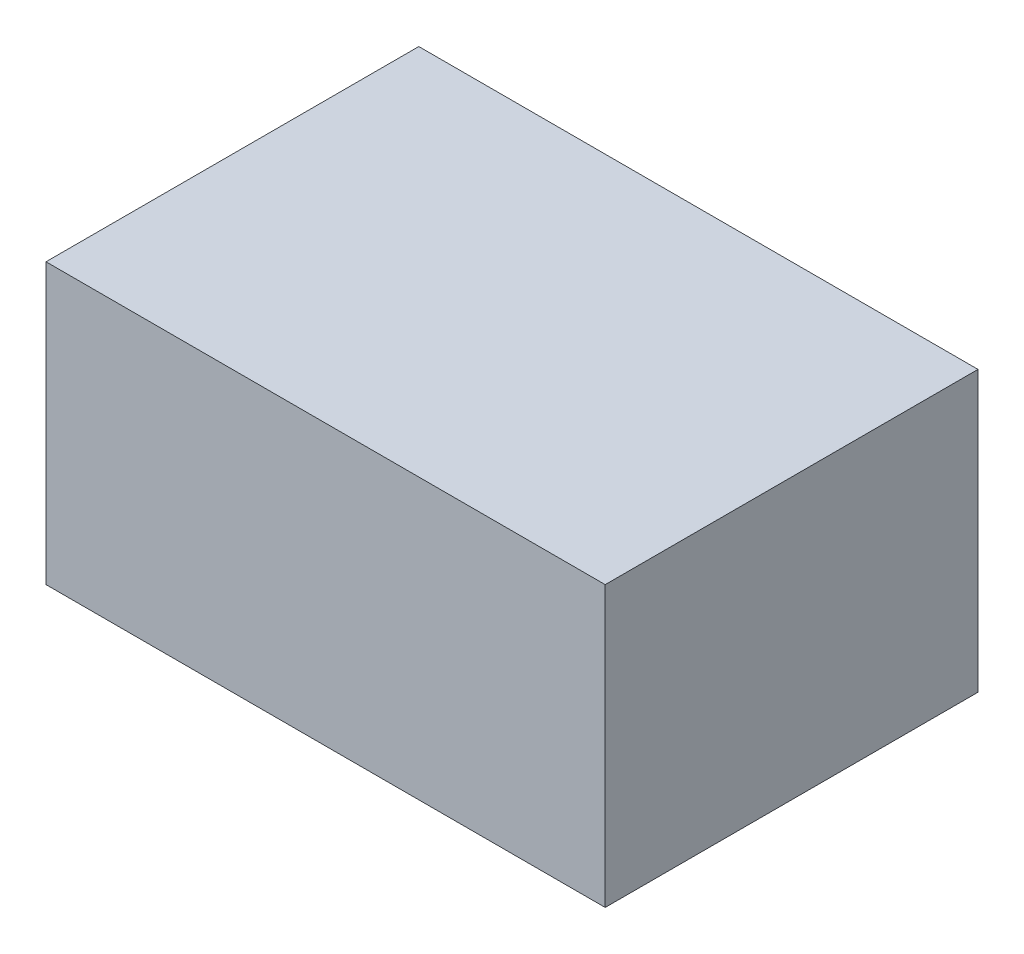
ISO-10303-21;
HEADER;
FILE_DESCRIPTION(('STEP AP214'),'2;1');
FILE_NAME('part.step','',(''),(''),'','','');
FILE_SCHEMA(('AUTOMOTIVE_DESIGN { 1 0 10303 214 1 1 1 1 }'));
ENDSEC;
DATA;
#1=APPLICATION_CONTEXT('core data for automotive mechanical design processes');
#2=APPLICATION_PROTOCOL_DEFINITION('international standard','automotive_design',2000,#1);
#3=PRODUCT_CONTEXT('',#1,'mechanical');
#4=PRODUCT('Part','Part','',(#3));
#5=PRODUCT_RELATED_PRODUCT_CATEGORY('part','',(#4));
#6=PRODUCT_DEFINITION_FORMATION('','',#4);
#7=PRODUCT_DEFINITION_CONTEXT('part definition',#1,'design');
#8=PRODUCT_DEFINITION('design','',#6,#7);
#9=PRODUCT_DEFINITION_SHAPE('','',#8);
#10=(LENGTH_UNIT() NAMED_UNIT(*) SI_UNIT(.MILLI.,.METRE.));
#11=(NAMED_UNIT(*) PLANE_ANGLE_UNIT() SI_UNIT($,.RADIAN.));
#12=(NAMED_UNIT(*) SI_UNIT($,.STERADIAN.) SOLID_ANGLE_UNIT());
#13=UNCERTAINTY_MEASURE_WITH_UNIT(LENGTH_MEASURE(1.E-05),#10,'distance_accuracy_value','');
#14=(GEOMETRIC_REPRESENTATION_CONTEXT(3) GLOBAL_UNCERTAINTY_ASSIGNED_CONTEXT((#13)) GLOBAL_UNIT_ASSIGNED_CONTEXT((#10,
#11,#12)) REPRESENTATION_CONTEXT('',''));
#15=CARTESIAN_POINT('',(0.,0.,0.));
#16=DIRECTION('',(0.,0.,1.));
#17=DIRECTION('',(1.,0.,0.));
#18=AXIS2_PLACEMENT_3D('',#15,#16,#17);
#19=CARTESIAN_POINT('',(-40.3235294117647,30.,-28.9705882352941));
#20=DIRECTION('',(1.,0.,0.));
#21=DIRECTION('',(0.,0.,-1.));
#22=AXIS2_PLACEMENT_3D('',#19,#20,#21);
#23=PLANE('',#22);
#24=DIRECTION('',(0.,0.,1.));
#25=VECTOR('',#24,1.);
#26=CARTESIAN_POINT('',(-40.3235294117647,0.,-28.9705882352941));
#27=LINE('',#26,#25);
#28=CARTESIAN_POINT('',(-40.3235294117647,0.,-28.9705882352941));
#29=VERTEX_POINT('',#28);
#30=CARTESIAN_POINT('',(-40.3235294117647,0.,11.0294117647059));
#31=VERTEX_POINT('',#30);
#32=EDGE_CURVE('E95',#29,#31,#27,.T.);
#33=ORIENTED_EDGE('',*,*,#32,.T.);
#34=DIRECTION('',(0.,-1.,0.));
#35=VECTOR('',#34,1.);
#36=CARTESIAN_POINT('',(-40.3235294117647,30.,11.0294117647059));
#37=LINE('',#36,#35);
#38=CARTESIAN_POINT('',(-40.3235294117647,30.,11.0294117647059));
#39=VERTEX_POINT('',#38);
#40=EDGE_CURVE('E11',#39,#31,#37,.T.);
#41=ORIENTED_EDGE('',*,*,#40,.F.);
#42=DIRECTION('',(0.,0.,1.));
#43=VECTOR('',#42,1.);
#44=CARTESIAN_POINT('',(-40.3235294117647,30.,-28.9705882352941));
#45=LINE('',#44,#43);
#46=CARTESIAN_POINT('',(-40.3235294117647,30.,-28.9705882352941));
#47=VERTEX_POINT('',#46);
#48=EDGE_CURVE('E83',#47,#39,#45,.T.);
#49=ORIENTED_EDGE('',*,*,#48,.F.);
#50=DIRECTION('',(0.,-1.,0.));
#51=VECTOR('',#50,1.);
#52=CARTESIAN_POINT('',(-40.3235294117647,30.,-28.9705882352941));
#53=LINE('',#52,#51);
#54=EDGE_CURVE('E91',#47,#29,#53,.T.);
#55=ORIENTED_EDGE('',*,*,#54,.T.);
#56=EDGE_LOOP('',(#33,#41,#49,#55));
#57=FACE_BOUND('',#56,.T.);
#58=ADVANCED_FACE('F32',(#57),#23,.F.);
#59=CARTESIAN_POINT('',(-40.3235294117647,30.,11.0294117647059));
#60=DIRECTION('',(0.,0.,-1.));
#61=DIRECTION('',(-1.,0.,0.));
#62=AXIS2_PLACEMENT_3D('',#59,#60,#61);
#63=PLANE('',#62);
#64=DIRECTION('',(1.,0.,0.));
#65=VECTOR('',#64,1.);
#66=CARTESIAN_POINT('',(-40.3235294117647,0.,11.0294117647059));
#67=LINE('',#66,#65);
#68=CARTESIAN_POINT('',(19.6764705882353,0.,11.0294117647059));
#69=VERTEX_POINT('',#68);
#70=EDGE_CURVE('E87',#31,#69,#67,.T.);
#71=ORIENTED_EDGE('',*,*,#70,.T.);
#72=DIRECTION('',(0.,-1.,0.));
#73=VECTOR('',#72,1.);
#74=CARTESIAN_POINT('',(19.6764705882353,30.,11.0294117647059));
#75=LINE('',#74,#73);
#76=CARTESIAN_POINT('',(19.6764705882353,30.,11.0294117647059));
#77=VERTEX_POINT('',#76);
#78=EDGE_CURVE('E40',#77,#69,#75,.T.);
#79=ORIENTED_EDGE('',*,*,#78,.F.);
#80=DIRECTION('',(1.,0.,0.));
#81=VECTOR('',#80,1.);
#82=CARTESIAN_POINT('',(-40.3235294117647,30.,11.0294117647059));
#83=LINE('',#82,#81);
#84=EDGE_CURVE('E78',#39,#77,#83,.T.);
#85=ORIENTED_EDGE('',*,*,#84,.F.);
#86=ORIENTED_EDGE('',*,*,#40,.T.);
#87=EDGE_LOOP('',(#71,#79,#85,#86));
#88=FACE_BOUND('',#87,.T.);
#89=ADVANCED_FACE('F86',(#88),#63,.F.);
#90=CARTESIAN_POINT('',(19.6764705882353,30.,-28.9705882352941));
#91=DIRECTION('',(-1.,0.,0.));
#92=DIRECTION('',(0.,0.,1.));
#93=AXIS2_PLACEMENT_3D('',#90,#91,#92);
#94=PLANE('',#93);
#95=DIRECTION('',(0.,0.,-1.));
#96=VECTOR('',#95,1.);
#97=CARTESIAN_POINT('',(19.6764705882353,0.,-28.9705882352941));
#98=LINE('',#97,#96);
#99=CARTESIAN_POINT('',(19.6764705882353,0.,-28.9705882352941));
#100=VERTEX_POINT('',#99);
#101=EDGE_CURVE('E65',#69,#100,#98,.T.);
#102=ORIENTED_EDGE('',*,*,#101,.T.);
#103=DIRECTION('',(0.,-1.,0.));
#104=VECTOR('',#103,1.);
#105=CARTESIAN_POINT('',(19.6764705882353,30.,-28.9705882352941));
#106=LINE('',#105,#104);
#107=CARTESIAN_POINT('',(19.6764705882353,30.,-28.9705882352941));
#108=VERTEX_POINT('',#107);
#109=EDGE_CURVE('E88',#108,#100,#106,.T.);
#110=ORIENTED_EDGE('',*,*,#109,.F.);
#111=DIRECTION('',(0.,0.,-1.));
#112=VECTOR('',#111,1.);
#113=CARTESIAN_POINT('',(19.6764705882353,30.,-28.9705882352941));
#114=LINE('',#113,#112);
#115=EDGE_CURVE('E81',#77,#108,#114,.T.);
#116=ORIENTED_EDGE('',*,*,#115,.F.);
#117=ORIENTED_EDGE('',*,*,#78,.T.);
#118=EDGE_LOOP('',(#102,#110,#116,#117));
#119=FACE_BOUND('',#118,.T.);
#120=ADVANCED_FACE('F89',(#119),#94,.F.);
#121=CARTESIAN_POINT('',(-40.3235294117647,30.,-28.9705882352941));
#122=DIRECTION('',(0.,0.,1.));
#123=DIRECTION('',(1.,0.,0.));
#124=AXIS2_PLACEMENT_3D('',#121,#122,#123);
#125=PLANE('',#124);
#126=DIRECTION('',(-1.,0.,0.));
#127=VECTOR('',#126,1.);
#128=CARTESIAN_POINT('',(-40.3235294117647,0.,-28.9705882352941));
#129=LINE('',#128,#127);
#130=EDGE_CURVE('E71',#100,#29,#129,.T.);
#131=ORIENTED_EDGE('',*,*,#130,.T.);
#132=ORIENTED_EDGE('',*,*,#54,.F.);
#133=DIRECTION('',(-1.,0.,0.));
#134=VECTOR('',#133,1.);
#135=CARTESIAN_POINT('',(-40.3235294117647,30.,-28.9705882352941));
#136=LINE('',#135,#134);
#137=EDGE_CURVE('E48',#108,#47,#136,.T.);
#138=ORIENTED_EDGE('',*,*,#137,.F.);
#139=ORIENTED_EDGE('',*,*,#109,.T.);
#140=EDGE_LOOP('',(#131,#132,#138,#139));
#141=FACE_BOUND('',#140,.T.);
#142=ADVANCED_FACE('F102',(#141),#125,.F.);
#143=CARTESIAN_POINT('',(0.,30.,0.));
#144=DIRECTION('',(0.,1.,0.));
#145=DIRECTION('',(0.,0.,1.));
#146=AXIS2_PLACEMENT_3D('',#143,#144,#145);
#147=PLANE('',#146);
#148=ORIENTED_EDGE('',*,*,#48,.T.);
#149=ORIENTED_EDGE('',*,*,#84,.T.);
#150=ORIENTED_EDGE('',*,*,#115,.T.);
#151=ORIENTED_EDGE('',*,*,#137,.T.);
#152=EDGE_LOOP('',(#148,#149,#150,#151));
#153=FACE_BOUND('',#152,.T.);
#154=ADVANCED_FACE('F79',(#153),#147,.T.);
#155=CARTESIAN_POINT('',(0.,0.,0.));
#156=DIRECTION('',(0.,1.,0.));
#157=DIRECTION('',(0.,0.,1.));
#158=AXIS2_PLACEMENT_3D('',#155,#156,#157);
#159=PLANE('',#158);
#160=ORIENTED_EDGE('',*,*,#32,.F.);
#161=ORIENTED_EDGE('',*,*,#130,.F.);
#162=ORIENTED_EDGE('',*,*,#101,.F.);
#163=ORIENTED_EDGE('',*,*,#70,.F.);
#164=EDGE_LOOP('',(#160,#161,#162,#163));
#165=FACE_BOUND('',#164,.T.);
#166=ADVANCED_FACE('F105',(#165),#159,.F.);
#167=CLOSED_SHELL('',(#58,#89,#120,#142,#154,#166));
#168=MANIFOLD_SOLID_BREP('B2',#167);
#169=ADVANCED_BREP_SHAPE_REPRESENTATION('',(#18,#168),#14);
#170=SHAPE_DEFINITION_REPRESENTATION(#9,#169);
ENDSEC;
END-ISO-10303-21;
